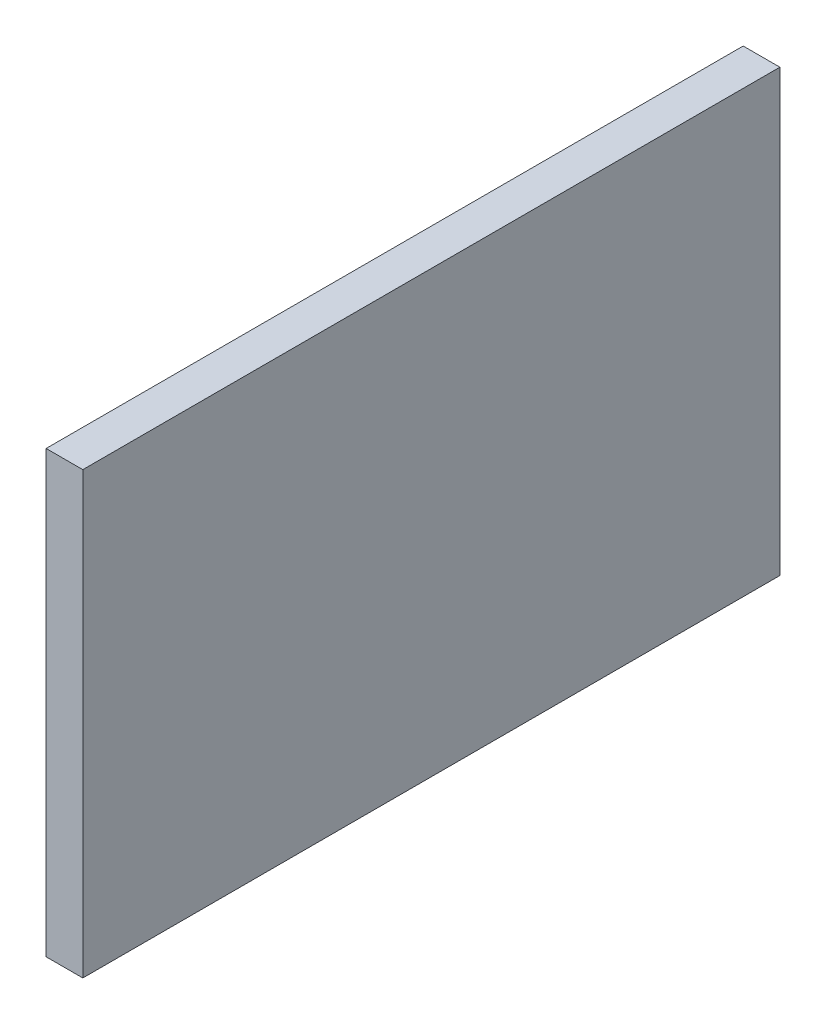
ISO-10303-21;
HEADER;
FILE_DESCRIPTION(('STEP AP214'),'2;1');
FILE_NAME('part.step','',(''),(''),'','','');
FILE_SCHEMA(('AUTOMOTIVE_DESIGN { 1 0 10303 214 1 1 1 1 }'));
ENDSEC;
DATA;
#1=APPLICATION_CONTEXT('core data for automotive mechanical design processes');
#2=APPLICATION_PROTOCOL_DEFINITION('international standard','automotive_design',2000,#1);
#3=PRODUCT_CONTEXT('',#1,'mechanical');
#4=PRODUCT('Part','Part','',(#3));
#5=PRODUCT_RELATED_PRODUCT_CATEGORY('part','',(#4));
#6=PRODUCT_DEFINITION_FORMATION('','',#4);
#7=PRODUCT_DEFINITION_CONTEXT('part definition',#1,'design');
#8=PRODUCT_DEFINITION('design','',#6,#7);
#9=PRODUCT_DEFINITION_SHAPE('','',#8);
#10=(LENGTH_UNIT() NAMED_UNIT(*) SI_UNIT(.MILLI.,.METRE.));
#11=(NAMED_UNIT(*) PLANE_ANGLE_UNIT() SI_UNIT($,.RADIAN.));
#12=(NAMED_UNIT(*) SI_UNIT($,.STERADIAN.) SOLID_ANGLE_UNIT());
#13=UNCERTAINTY_MEASURE_WITH_UNIT(LENGTH_MEASURE(1.E-05),#10,'distance_accuracy_value','');
#14=(GEOMETRIC_REPRESENTATION_CONTEXT(3) GLOBAL_UNCERTAINTY_ASSIGNED_CONTEXT((#13)) GLOBAL_UNIT_ASSIGNED_CONTEXT((#10,
#11,#12)) REPRESENTATION_CONTEXT('',''));
#15=CARTESIAN_POINT('',(0.,0.,0.));
#16=DIRECTION('',(0.,0.,1.));
#17=DIRECTION('',(1.,0.,0.));
#18=AXIS2_PLACEMENT_3D('',#15,#16,#17);
#19=CARTESIAN_POINT('',(38.1,0.,342.9));
#20=DIRECTION('',(0.,-1.,0.));
#21=DIRECTION('',(0.,0.,-1.));
#22=AXIS2_PLACEMENT_3D('',#19,#20,#21);
#23=PLANE('',#22);
#24=DIRECTION('',(0.,0.,1.));
#25=VECTOR('',#24,1.);
#26=CARTESIAN_POINT('',(0.,0.,342.9));
#27=LINE('',#26,#25);
#28=CARTESIAN_POINT('',(0.,0.,-38.1));
#29=VERTEX_POINT('',#28);
#30=CARTESIAN_POINT('',(0.,0.,685.8));
#31=VERTEX_POINT('',#30);
#32=EDGE_CURVE('E70',#29,#31,#27,.T.);
#33=ORIENTED_EDGE('',*,*,#32,.T.);
#34=DIRECTION('',(-1.,0.,0.));
#35=VECTOR('',#34,1.);
#36=CARTESIAN_POINT('',(38.1,0.,685.8));
#37=LINE('',#36,#35);
#38=CARTESIAN_POINT('',(38.1,0.,685.8));
#39=VERTEX_POINT('',#38);
#40=EDGE_CURVE('E11',#39,#31,#37,.T.);
#41=ORIENTED_EDGE('',*,*,#40,.F.);
#42=DIRECTION('',(0.,0.,1.));
#43=VECTOR('',#42,1.);
#44=CARTESIAN_POINT('',(38.1,0.,342.9));
#45=LINE('',#44,#43);
#46=CARTESIAN_POINT('',(38.1,0.,-38.1));
#47=VERTEX_POINT('',#46);
#48=EDGE_CURVE('E98',#47,#39,#45,.T.);
#49=ORIENTED_EDGE('',*,*,#48,.F.);
#50=DIRECTION('',(1.,0.,0.));
#51=VECTOR('',#50,1.);
#52=CARTESIAN_POINT('',(0.,0.,-38.1));
#53=LINE('',#52,#51);
#54=EDGE_CURVE('E97',#29,#47,#53,.T.);
#55=ORIENTED_EDGE('',*,*,#54,.F.);
#56=EDGE_LOOP('',(#33,#41,#49,#55));
#57=FACE_BOUND('',#56,.T.);
#58=ADVANCED_FACE('F36',(#57),#23,.F.);
#59=CARTESIAN_POINT('',(38.1,-280.476808726494,685.8));
#60=DIRECTION('',(0.,0.,-1.));
#61=DIRECTION('',(-1.,0.,0.));
#62=AXIS2_PLACEMENT_3D('',#59,#60,#61);
#63=PLANE('',#62);
#64=DIRECTION('',(0.,-1.,0.));
#65=VECTOR('',#64,1.);
#66=CARTESIAN_POINT('',(0.,-280.476808726494,685.8));
#67=LINE('',#66,#65);
#68=CARTESIAN_POINT('',(0.,-457.2,685.8));
#69=VERTEX_POINT('',#68);
#70=EDGE_CURVE('E92',#31,#69,#67,.T.);
#71=ORIENTED_EDGE('',*,*,#70,.T.);
#72=DIRECTION('',(-1.,0.,0.));
#73=VECTOR('',#72,1.);
#74=CARTESIAN_POINT('',(38.1,-457.2,685.8));
#75=LINE('',#74,#73);
#76=CARTESIAN_POINT('',(38.1,-457.2,685.8));
#77=VERTEX_POINT('',#76);
#78=EDGE_CURVE('E45',#77,#69,#75,.T.);
#79=ORIENTED_EDGE('',*,*,#78,.F.);
#80=DIRECTION('',(0.,-1.,0.));
#81=VECTOR('',#80,1.);
#82=CARTESIAN_POINT('',(38.1,-280.476808726494,685.8));
#83=LINE('',#82,#81);
#84=EDGE_CURVE('E56',#39,#77,#83,.T.);
#85=ORIENTED_EDGE('',*,*,#84,.F.);
#86=ORIENTED_EDGE('',*,*,#40,.T.);
#87=EDGE_LOOP('',(#71,#79,#85,#86));
#88=FACE_BOUND('',#87,.T.);
#89=ADVANCED_FACE('F124',(#88),#63,.F.);
#90=CARTESIAN_POINT('',(38.1,-457.2,342.9));
#91=DIRECTION('',(0.,-1.,0.));
#92=DIRECTION('',(0.,0.,-1.));
#93=AXIS2_PLACEMENT_3D('',#90,#91,#92);
#94=PLANE('',#93);
#95=DIRECTION('',(0.,0.,1.));
#96=VECTOR('',#95,1.);
#97=CARTESIAN_POINT('',(0.,-457.2,342.9));
#98=LINE('',#97,#96);
#99=CARTESIAN_POINT('',(0.,-457.2,-38.1));
#100=VERTEX_POINT('',#99);
#101=EDGE_CURVE('E77',#100,#69,#98,.T.);
#102=ORIENTED_EDGE('',*,*,#101,.F.);
#103=DIRECTION('',(-1.,0.,0.));
#104=VECTOR('',#103,1.);
#105=CARTESIAN_POINT('',(0.,-457.2,-38.1));
#106=LINE('',#105,#104);
#107=CARTESIAN_POINT('',(38.1,-457.2,-38.1));
#108=VERTEX_POINT('',#107);
#109=EDGE_CURVE('E94',#108,#100,#106,.T.);
#110=ORIENTED_EDGE('',*,*,#109,.F.);
#111=DIRECTION('',(0.,0.,1.));
#112=VECTOR('',#111,1.);
#113=CARTESIAN_POINT('',(38.1,-457.2,342.9));
#114=LINE('',#113,#112);
#115=EDGE_CURVE('E113',#108,#77,#114,.T.);
#116=ORIENTED_EDGE('',*,*,#115,.T.);
#117=ORIENTED_EDGE('',*,*,#78,.T.);
#118=EDGE_LOOP('',(#102,#110,#116,#117));
#119=FACE_BOUND('',#118,.T.);
#120=ADVANCED_FACE('F122',(#119),#94,.T.);
#121=CARTESIAN_POINT('',(38.1,-228.6,342.9));
#122=DIRECTION('',(1.,0.,0.));
#123=DIRECTION('',(0.,1.,0.));
#124=AXIS2_PLACEMENT_3D('',#121,#122,#123);
#125=PLANE('',#124);
#126=ORIENTED_EDGE('',*,*,#115,.F.);
#127=DIRECTION('',(0.,-1.,0.));
#128=VECTOR('',#127,1.);
#129=CARTESIAN_POINT('',(38.1,0.,-38.1));
#130=LINE('',#129,#128);
#131=EDGE_CURVE('E102',#47,#108,#130,.T.);
#132=ORIENTED_EDGE('',*,*,#131,.F.);
#133=ORIENTED_EDGE('',*,*,#48,.T.);
#134=ORIENTED_EDGE('',*,*,#84,.T.);
#135=EDGE_LOOP('',(#126,#132,#133,#134));
#136=FACE_BOUND('',#135,.T.);
#137=ADVANCED_FACE('F130',(#136),#125,.T.);
#138=CARTESIAN_POINT('',(0.,-228.6,342.9));
#139=DIRECTION('',(1.,0.,0.));
#140=DIRECTION('',(0.,1.,0.));
#141=AXIS2_PLACEMENT_3D('',#138,#139,#140);
#142=PLANE('',#141);
#143=ORIENTED_EDGE('',*,*,#32,.F.);
#144=DIRECTION('',(0.,1.,0.));
#145=VECTOR('',#144,1.);
#146=CARTESIAN_POINT('',(0.,0.,-38.1));
#147=LINE('',#146,#145);
#148=EDGE_CURVE('E90',#100,#29,#147,.T.);
#149=ORIENTED_EDGE('',*,*,#148,.F.);
#150=ORIENTED_EDGE('',*,*,#101,.T.);
#151=ORIENTED_EDGE('',*,*,#70,.F.);
#152=EDGE_LOOP('',(#143,#149,#150,#151));
#153=FACE_BOUND('',#152,.T.);
#154=ADVANCED_FACE('F88',(#153),#142,.F.);
#155=CARTESIAN_POINT('',(0.,0.,-38.1));
#156=DIRECTION('',(0.,0.,1.));
#157=DIRECTION('',(1.,0.,0.));
#158=AXIS2_PLACEMENT_3D('',#155,#156,#157);
#159=PLANE('',#158);
#160=ORIENTED_EDGE('',*,*,#148,.T.);
#161=ORIENTED_EDGE('',*,*,#54,.T.);
#162=ORIENTED_EDGE('',*,*,#131,.T.);
#163=ORIENTED_EDGE('',*,*,#109,.T.);
#164=EDGE_LOOP('',(#160,#161,#162,#163));
#165=FACE_BOUND('',#164,.T.);
#166=ADVANCED_FACE('F104',(#165),#159,.F.);
#167=CLOSED_SHELL('',(#58,#89,#120,#137,#154,#166));
#168=MANIFOLD_SOLID_BREP('B2',#167);
#169=ADVANCED_BREP_SHAPE_REPRESENTATION('',(#18,#168),#14);
#170=SHAPE_DEFINITION_REPRESENTATION(#9,#169);
ENDSEC;
END-ISO-10303-21;
